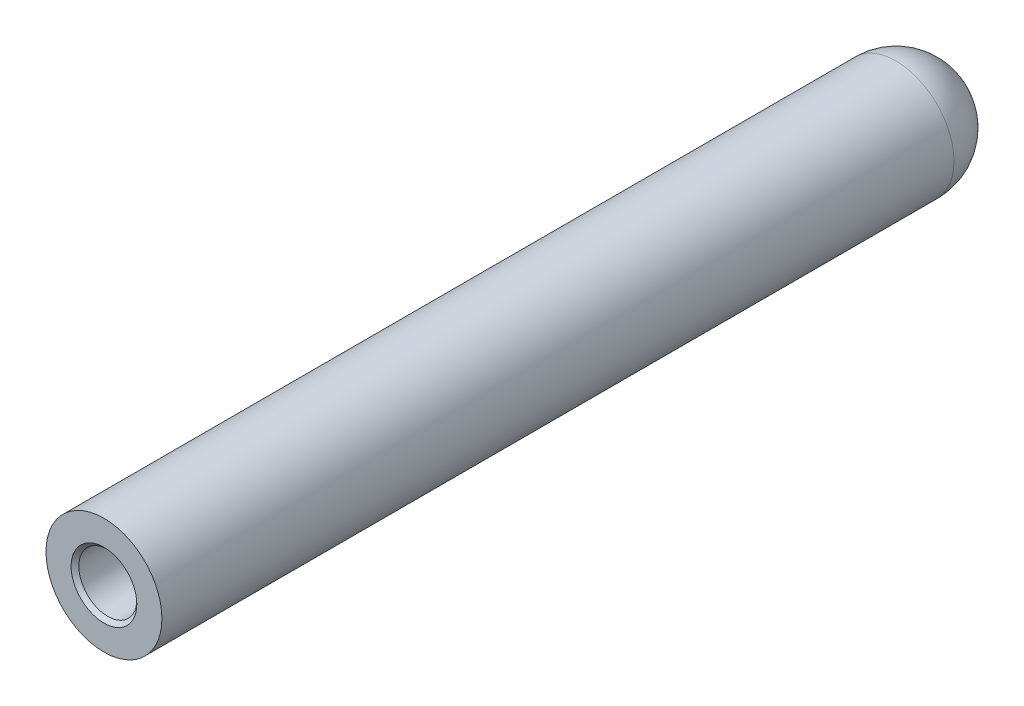
ISO-10303-21;
HEADER;
FILE_DESCRIPTION(('STEP AP214'),'2;1');
FILE_NAME('part.step','',(''),(''),'','','');
FILE_SCHEMA(('AUTOMOTIVE_DESIGN { 1 0 10303 214 1 1 1 1 }'));
ENDSEC;
DATA;
#1=APPLICATION_CONTEXT('core data for automotive mechanical design processes');
#2=APPLICATION_PROTOCOL_DEFINITION('international standard','automotive_design',2000,#1);
#3=PRODUCT_CONTEXT('',#1,'mechanical');
#4=PRODUCT('Part','Part','',(#3));
#5=PRODUCT_RELATED_PRODUCT_CATEGORY('part','',(#4));
#6=PRODUCT_DEFINITION_FORMATION('','',#4);
#7=PRODUCT_DEFINITION_CONTEXT('part definition',#1,'design');
#8=PRODUCT_DEFINITION('design','',#6,#7);
#9=PRODUCT_DEFINITION_SHAPE('','',#8);
#10=(LENGTH_UNIT() NAMED_UNIT(*) SI_UNIT(.MILLI.,.METRE.));
#11=(NAMED_UNIT(*) PLANE_ANGLE_UNIT() SI_UNIT($,.RADIAN.));
#12=(NAMED_UNIT(*) SI_UNIT($,.STERADIAN.) SOLID_ANGLE_UNIT());
#13=UNCERTAINTY_MEASURE_WITH_UNIT(LENGTH_MEASURE(1.E-05),#10,'distance_accuracy_value','');
#14=(GEOMETRIC_REPRESENTATION_CONTEXT(3) GLOBAL_UNCERTAINTY_ASSIGNED_CONTEXT((#13)) GLOBAL_UNIT_ASSIGNED_CONTEXT((#10,
#11,#12)) REPRESENTATION_CONTEXT('',''));
#15=CARTESIAN_POINT('',(0.,0.,0.));
#16=DIRECTION('',(0.,0.,1.));
#17=DIRECTION('',(1.,0.,0.));
#18=AXIS2_PLACEMENT_3D('',#15,#16,#17);
#19=CARTESIAN_POINT('',(0.,0.,139.7));
#20=DIRECTION('',(0.,0.,-1.));
#21=DIRECTION('',(-1.,0.,0.));
#22=AXIS2_PLACEMENT_3D('',#19,#20,#21);
#23=CYLINDRICAL_SURFACE('',#22,9.525);
#24=CARTESIAN_POINT('',(0.,0.,9.52500000000001));
#25=DIRECTION('',(0.,0.,-1.));
#26=DIRECTION('',(-1.,0.,0.));
#27=AXIS2_PLACEMENT_3D('',#24,#25,#26);
#28=CIRCLE('',#27,9.525);
#29=CARTESIAN_POINT('',(-9.525,0.,9.52500000000001));
#30=VERTEX_POINT('',#29);
#31=EDGE_CURVE('E11',#30,#30,#28,.F.);
#32=ORIENTED_EDGE('',*,*,#31,.T.);
#33=EDGE_LOOP('',(#32));
#34=FACE_BOUND('',#33,.T.);
#35=CARTESIAN_POINT('',(0.,0.,139.7));
#36=DIRECTION('',(0.,0.,1.));
#37=DIRECTION('',(1.,0.,0.));
#38=AXIS2_PLACEMENT_3D('',#35,#36,#37);
#39=CIRCLE('',#38,9.525);
#40=CARTESIAN_POINT('',(9.525,0.,139.7));
#41=VERTEX_POINT('',#40);
#42=EDGE_CURVE('E39',#41,#41,#39,.T.);
#43=ORIENTED_EDGE('',*,*,#42,.F.);
#44=EDGE_LOOP('',(#43));
#45=FACE_BOUND('',#44,.T.);
#46=ADVANCED_FACE('F32',(#34,#45),#23,.T.);
#47=CARTESIAN_POINT('',(0.,0.,139.7));
#48=DIRECTION('',(0.,0.,1.));
#49=DIRECTION('',(1.,0.,0.));
#50=AXIS2_PLACEMENT_3D('',#47,#48,#49);
#51=PLANE('',#50);
#52=CARTESIAN_POINT('',(0.,0.,139.7));
#53=DIRECTION('',(0.,0.,1.));
#54=DIRECTION('',(1.,0.,0.));
#55=AXIS2_PLACEMENT_3D('',#52,#53,#54);
#56=CIRCLE('',#55,5.3975);
#57=CARTESIAN_POINT('',(5.3975,0.,139.7));
#58=VERTEX_POINT('',#57);
#59=EDGE_CURVE('E63',#58,#58,#56,.T.);
#60=ORIENTED_EDGE('',*,*,#59,.F.);
#61=EDGE_LOOP('',(#60));
#62=FACE_BOUND('',#61,.T.);
#63=ORIENTED_EDGE('',*,*,#42,.T.);
#64=EDGE_LOOP('',(#63));
#65=FACE_BOUND('',#64,.T.);
#66=ADVANCED_FACE('F69',(#62,#65),#51,.T.);
#67=CARTESIAN_POINT('',(0.,0.,9.52500000000001));
#68=DIRECTION('',(0.,0.,1.));
#69=DIRECTION('',(1.,0.,0.));
#70=AXIS2_PLACEMENT_3D('',#67,#68,#69);
#71=SPHERICAL_SURFACE('',#70,9.525);
#72=ORIENTED_EDGE('',*,*,#31,.F.);
#73=EDGE_LOOP('',(#72));
#74=FACE_BOUND('',#73,.T.);
#75=ADVANCED_FACE('F34',(#74),#71,.T.);
#76=CARTESIAN_POINT('',(0.,0.,99.9998));
#77=DIRECTION('',(0.,0.,1.));
#78=DIRECTION('',(1.,0.,0.));
#79=AXIS2_PLACEMENT_3D('',#76,#77,#78);
#80=CONICAL_SURFACE('',#79,3.96874999999999,1.02974425867665);
#81=CARTESIAN_POINT('',(0.,0.,97.6151344182344));
#82=VERTEX_POINT('',#81);
#83=VERTEX_LOOP('',#82);
#84=FACE_BOUND('',#83,.T.);
#85=CARTESIAN_POINT('',(0.,0.,99.9998));
#86=DIRECTION('',(0.,0.,1.));
#87=DIRECTION('',(1.,0.,0.));
#88=AXIS2_PLACEMENT_3D('',#85,#86,#87);
#89=CIRCLE('',#88,3.96874999999999);
#90=CARTESIAN_POINT('',(3.96874999999999,0.,99.9998));
#91=VERTEX_POINT('',#90);
#92=EDGE_CURVE('E49',#91,#91,#89,.T.);
#93=ORIENTED_EDGE('',*,*,#92,.T.);
#94=EDGE_LOOP('',(#93));
#95=FACE_BOUND('',#94,.T.);
#96=ADVANCED_FACE('F42',(#84,#95),#80,.F.);
#97=CARTESIAN_POINT('',(0.,0.,139.7));
#98=DIRECTION('',(0.,0.,1.));
#99=DIRECTION('',(1.,0.,0.));
#100=AXIS2_PLACEMENT_3D('',#97,#98,#99);
#101=CYLINDRICAL_SURFACE('',#100,3.96874999999999);
#102=ORIENTED_EDGE('',*,*,#92,.F.);
#103=EDGE_LOOP('',(#102));
#104=FACE_BOUND('',#103,.T.);
#105=CARTESIAN_POINT('',(0.,0.,107.95));
#106=DIRECTION('',(0.,0.,1.));
#107=DIRECTION('',(1.,0.,0.));
#108=AXIS2_PLACEMENT_3D('',#105,#106,#107);
#109=CIRCLE('',#108,3.96874999999999);
#110=CARTESIAN_POINT('',(3.96874999999999,0.,107.95));
#111=VERTEX_POINT('',#110);
#112=EDGE_CURVE('E51',#111,#111,#109,.T.);
#113=ORIENTED_EDGE('',*,*,#112,.T.);
#114=EDGE_LOOP('',(#113));
#115=FACE_BOUND('',#114,.T.);
#116=ADVANCED_FACE('F45',(#104,#115),#101,.F.);
#117=CARTESIAN_POINT('',(3.96874999999999,0.,107.95));
#118=DIRECTION('',(0.,0.,-1.));
#119=DIRECTION('',(-1.,0.,0.));
#120=AXIS2_PLACEMENT_3D('',#117,#118,#119);
#121=PLANE('',#120);
#122=ORIENTED_EDGE('',*,*,#112,.F.);
#123=EDGE_LOOP('',(#122));
#124=FACE_BOUND('',#123,.T.);
#125=CARTESIAN_POINT('',(0.,0.,107.95));
#126=DIRECTION('',(0.,0.,1.));
#127=DIRECTION('',(1.,0.,0.));
#128=AXIS2_PLACEMENT_3D('',#125,#126,#127);
#129=CIRCLE('',#128,4.76249999999999);
#130=CARTESIAN_POINT('',(4.76249999999999,0.,107.95));
#131=VERTEX_POINT('',#130);
#132=EDGE_CURVE('E55',#131,#131,#129,.T.);
#133=ORIENTED_EDGE('',*,*,#132,.T.);
#134=EDGE_LOOP('',(#133));
#135=FACE_BOUND('',#134,.T.);
#136=ADVANCED_FACE('F82',(#124,#135),#121,.F.);
#137=CARTESIAN_POINT('',(0.,0.,139.7));
#138=DIRECTION('',(0.,0.,1.));
#139=DIRECTION('',(1.,0.,0.));
#140=AXIS2_PLACEMENT_3D('',#137,#138,#139);
#141=CYLINDRICAL_SURFACE('',#140,4.76249999999999);
#142=ORIENTED_EDGE('',*,*,#132,.F.);
#143=EDGE_LOOP('',(#142));
#144=FACE_BOUND('',#143,.T.);
#145=CARTESIAN_POINT('',(0.,0.,139.065));
#146=DIRECTION('',(0.,0.,1.));
#147=DIRECTION('',(1.,0.,0.));
#148=AXIS2_PLACEMENT_3D('',#145,#146,#147);
#149=CIRCLE('',#148,4.7625);
#150=CARTESIAN_POINT('',(4.7625,0.,139.065));
#151=VERTEX_POINT('',#150);
#152=EDGE_CURVE('E60',#151,#151,#149,.T.);
#153=ORIENTED_EDGE('',*,*,#152,.T.);
#154=EDGE_LOOP('',(#153));
#155=FACE_BOUND('',#154,.T.);
#156=ADVANCED_FACE('F85',(#144,#155),#141,.F.);
#157=CARTESIAN_POINT('',(0.,0.,139.7));
#158=DIRECTION('',(0.,0.,1.));
#159=DIRECTION('',(1.,0.,0.));
#160=AXIS2_PLACEMENT_3D('',#157,#158,#159);
#161=CONICAL_SURFACE('',#160,5.3975,0.785398163397454);
#162=ORIENTED_EDGE('',*,*,#152,.F.);
#163=EDGE_LOOP('',(#162));
#164=FACE_BOUND('',#163,.T.);
#165=ORIENTED_EDGE('',*,*,#59,.T.);
#166=EDGE_LOOP('',(#165));
#167=FACE_BOUND('',#166,.T.);
#168=ADVANCED_FACE('F67',(#164,#167),#161,.F.);
#169=CLOSED_SHELL('',(#46,#66,#75,#96,#116,#136,#156,#168));
#170=MANIFOLD_SOLID_BREP('B2',#169);
#171=ADVANCED_BREP_SHAPE_REPRESENTATION('',(#18,#170),#14);
#172=SHAPE_DEFINITION_REPRESENTATION(#9,#171);
ENDSEC;
END-ISO-10303-21;
